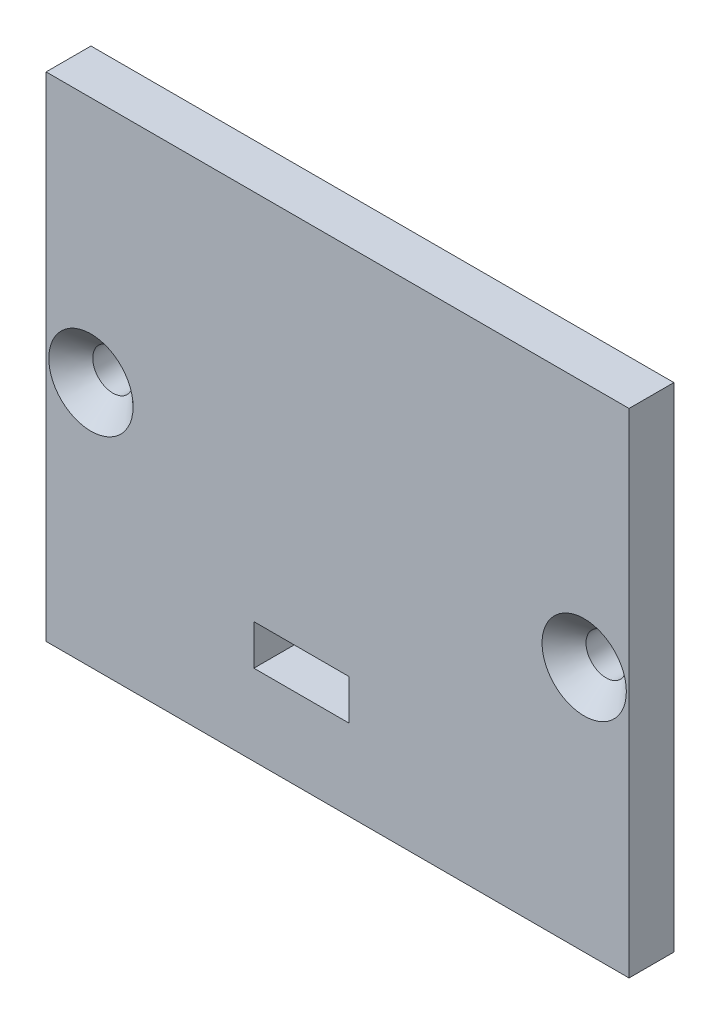
ISO-10303-21;
HEADER;
FILE_DESCRIPTION(('STEP AP214'),'2;1');
FILE_NAME('part.step','',(''),(''),'','','');
FILE_SCHEMA(('AUTOMOTIVE_DESIGN { 1 0 10303 214 1 1 1 1 }'));
ENDSEC;
DATA;
#1=APPLICATION_CONTEXT('core data for automotive mechanical design processes');
#2=APPLICATION_PROTOCOL_DEFINITION('international standard','automotive_design',2000,#1);
#3=PRODUCT_CONTEXT('',#1,'mechanical');
#4=PRODUCT('Part','Part','',(#3));
#5=PRODUCT_RELATED_PRODUCT_CATEGORY('part','',(#4));
#6=PRODUCT_DEFINITION_FORMATION('','',#4);
#7=PRODUCT_DEFINITION_CONTEXT('part definition',#1,'design');
#8=PRODUCT_DEFINITION('design','',#6,#7);
#9=PRODUCT_DEFINITION_SHAPE('','',#8);
#10=(LENGTH_UNIT() NAMED_UNIT(*) SI_UNIT(.MILLI.,.METRE.));
#11=(NAMED_UNIT(*) PLANE_ANGLE_UNIT() SI_UNIT($,.RADIAN.));
#12=(NAMED_UNIT(*) SI_UNIT($,.STERADIAN.) SOLID_ANGLE_UNIT());
#13=UNCERTAINTY_MEASURE_WITH_UNIT(LENGTH_MEASURE(1.E-05),#10,'distance_accuracy_value','');
#14=(GEOMETRIC_REPRESENTATION_CONTEXT(3) GLOBAL_UNCERTAINTY_ASSIGNED_CONTEXT((#13)) GLOBAL_UNIT_ASSIGNED_CONTEXT((#10,
#11,#12)) REPRESENTATION_CONTEXT('',''));
#15=CARTESIAN_POINT('',(0.,0.,0.));
#16=DIRECTION('',(0.,0.,1.));
#17=DIRECTION('',(1.,0.,0.));
#18=AXIS2_PLACEMENT_3D('',#15,#16,#17);
#19=CARTESIAN_POINT('',(0.,0.,5.));
#20=DIRECTION('',(1.,0.,0.));
#21=DIRECTION('',(0.,0.,-1.));
#22=AXIS2_PLACEMENT_3D('',#19,#20,#21);
#23=PLANE('',#22);
#24=DIRECTION('',(0.,-1.,0.));
#25=VECTOR('',#24,1.);
#26=CARTESIAN_POINT('',(0.,0.,0.));
#27=LINE('',#26,#25);
#28=CARTESIAN_POINT('',(0.,55.,0.));
#29=VERTEX_POINT('',#28);
#30=CARTESIAN_POINT('',(0.,0.,0.));
#31=VERTEX_POINT('',#30);
#32=EDGE_CURVE('E150',#29,#31,#27,.T.);
#33=ORIENTED_EDGE('',*,*,#32,.T.);
#34=DIRECTION('',(0.,0.,-1.));
#35=VECTOR('',#34,1.);
#36=CARTESIAN_POINT('',(0.,0.,5.));
#37=LINE('',#36,#35);
#38=CARTESIAN_POINT('',(0.,0.,5.));
#39=VERTEX_POINT('',#38);
#40=EDGE_CURVE('E11',#39,#31,#37,.T.);
#41=ORIENTED_EDGE('',*,*,#40,.F.);
#42=DIRECTION('',(0.,-1.,0.));
#43=VECTOR('',#42,1.);
#44=CARTESIAN_POINT('',(0.,0.,5.));
#45=LINE('',#44,#43);
#46=CARTESIAN_POINT('',(0.,55.,5.));
#47=VERTEX_POINT('',#46);
#48=EDGE_CURVE('E151',#47,#39,#45,.T.);
#49=ORIENTED_EDGE('',*,*,#48,.F.);
#50=DIRECTION('',(0.,0.,-1.));
#51=VECTOR('',#50,1.);
#52=CARTESIAN_POINT('',(0.,55.,5.));
#53=LINE('',#52,#51);
#54=EDGE_CURVE('E161',#47,#29,#53,.T.);
#55=ORIENTED_EDGE('',*,*,#54,.T.);
#56=EDGE_LOOP('',(#33,#41,#49,#55));
#57=FACE_BOUND('',#56,.T.);
#58=ADVANCED_FACE('F32',(#57),#23,.F.);
#59=CARTESIAN_POINT('',(0.,0.,5.));
#60=DIRECTION('',(0.,1.,0.));
#61=DIRECTION('',(0.,0.,1.));
#62=AXIS2_PLACEMENT_3D('',#59,#60,#61);
#63=PLANE('',#62);
#64=DIRECTION('',(1.,0.,0.));
#65=VECTOR('',#64,1.);
#66=CARTESIAN_POINT('',(0.,0.,0.));
#67=LINE('',#66,#65);
#68=CARTESIAN_POINT('',(65.,0.,0.));
#69=VERTEX_POINT('',#68);
#70=EDGE_CURVE('E164',#31,#69,#67,.T.);
#71=ORIENTED_EDGE('',*,*,#70,.T.);
#72=DIRECTION('',(0.,0.,-1.));
#73=VECTOR('',#72,1.);
#74=CARTESIAN_POINT('',(65.,0.,5.));
#75=LINE('',#74,#73);
#76=CARTESIAN_POINT('',(65.,0.,5.));
#77=VERTEX_POINT('',#76);
#78=EDGE_CURVE('E39',#77,#69,#75,.T.);
#79=ORIENTED_EDGE('',*,*,#78,.F.);
#80=DIRECTION('',(1.,0.,0.));
#81=VECTOR('',#80,1.);
#82=CARTESIAN_POINT('',(0.,0.,5.));
#83=LINE('',#82,#81);
#84=EDGE_CURVE('E154',#39,#77,#83,.T.);
#85=ORIENTED_EDGE('',*,*,#84,.F.);
#86=ORIENTED_EDGE('',*,*,#40,.T.);
#87=EDGE_LOOP('',(#71,#79,#85,#86));
#88=FACE_BOUND('',#87,.T.);
#89=ADVANCED_FACE('F193',(#88),#63,.F.);
#90=CARTESIAN_POINT('',(65.,0.,5.));
#91=DIRECTION('',(-1.,0.,0.));
#92=DIRECTION('',(0.,0.,1.));
#93=AXIS2_PLACEMENT_3D('',#90,#91,#92);
#94=PLANE('',#93);
#95=DIRECTION('',(0.,1.,0.));
#96=VECTOR('',#95,1.);
#97=CARTESIAN_POINT('',(65.,0.,0.));
#98=LINE('',#97,#96);
#99=CARTESIAN_POINT('',(65.,55.,0.));
#100=VERTEX_POINT('',#99);
#101=EDGE_CURVE('E166',#69,#100,#98,.T.);
#102=ORIENTED_EDGE('',*,*,#101,.T.);
#103=DIRECTION('',(0.,0.,-1.));
#104=VECTOR('',#103,1.);
#105=CARTESIAN_POINT('',(65.,55.,5.));
#106=LINE('',#105,#104);
#107=CARTESIAN_POINT('',(65.,55.,5.));
#108=VERTEX_POINT('',#107);
#109=EDGE_CURVE('E171',#108,#100,#106,.T.);
#110=ORIENTED_EDGE('',*,*,#109,.F.);
#111=DIRECTION('',(0.,1.,0.));
#112=VECTOR('',#111,1.);
#113=CARTESIAN_POINT('',(65.,0.,5.));
#114=LINE('',#113,#112);
#115=EDGE_CURVE('E157',#77,#108,#114,.T.);
#116=ORIENTED_EDGE('',*,*,#115,.F.);
#117=ORIENTED_EDGE('',*,*,#78,.T.);
#118=EDGE_LOOP('',(#102,#110,#116,#117));
#119=FACE_BOUND('',#118,.T.);
#120=ADVANCED_FACE('F178',(#119),#94,.F.);
#121=CARTESIAN_POINT('',(0.,55.,5.));
#122=DIRECTION('',(0.,-1.,0.));
#123=DIRECTION('',(0.,0.,-1.));
#124=AXIS2_PLACEMENT_3D('',#121,#122,#123);
#125=PLANE('',#124);
#126=DIRECTION('',(-1.,0.,0.));
#127=VECTOR('',#126,1.);
#128=CARTESIAN_POINT('',(0.,55.,0.));
#129=LINE('',#128,#127);
#130=EDGE_CURVE('E155',#100,#29,#129,.T.);
#131=ORIENTED_EDGE('',*,*,#130,.T.);
#132=ORIENTED_EDGE('',*,*,#54,.F.);
#133=DIRECTION('',(-1.,0.,0.));
#134=VECTOR('',#133,1.);
#135=CARTESIAN_POINT('',(0.,55.,5.));
#136=LINE('',#135,#134);
#137=EDGE_CURVE('E159',#108,#47,#136,.T.);
#138=ORIENTED_EDGE('',*,*,#137,.F.);
#139=ORIENTED_EDGE('',*,*,#109,.T.);
#140=EDGE_LOOP('',(#131,#132,#138,#139));
#141=FACE_BOUND('',#140,.T.);
#142=ADVANCED_FACE('F186',(#141),#125,.F.);
#143=CARTESIAN_POINT('',(0.,0.,5.));
#144=DIRECTION('',(0.,0.,-1.));
#145=DIRECTION('',(-1.,0.,0.));
#146=AXIS2_PLACEMENT_3D('',#143,#144,#145);
#147=PLANE('',#146);
#148=DIRECTION('',(0.,-1.,0.));
#149=VECTOR('',#148,1.);
#150=CARTESIAN_POINT('',(23.1683541513135,9.,5.));
#151=LINE('',#150,#149);
#152=CARTESIAN_POINT('',(23.1683541513135,13.5,5.));
#153=VERTEX_POINT('',#152);
#154=CARTESIAN_POINT('',(23.1683541513135,9.,5.));
#155=VERTEX_POINT('',#154);
#156=EDGE_CURVE('E123',#153,#155,#151,.T.);
#157=ORIENTED_EDGE('',*,*,#156,.F.);
#158=DIRECTION('',(-1.,0.,0.));
#159=VECTOR('',#158,1.);
#160=CARTESIAN_POINT('',(23.1683541513135,13.5,5.));
#161=LINE('',#160,#159);
#162=CARTESIAN_POINT('',(33.7684187196315,13.5,5.));
#163=VERTEX_POINT('',#162);
#164=EDGE_CURVE('E46',#163,#153,#161,.T.);
#165=ORIENTED_EDGE('',*,*,#164,.F.);
#166=DIRECTION('',(0.,1.,0.));
#167=VECTOR('',#166,1.);
#168=CARTESIAN_POINT('',(33.7684187196315,13.5,5.));
#169=LINE('',#168,#167);
#170=CARTESIAN_POINT('',(33.7684187196315,9.,5.));
#171=VERTEX_POINT('',#170);
#172=EDGE_CURVE('E114',#171,#163,#169,.T.);
#173=ORIENTED_EDGE('',*,*,#172,.F.);
#174=DIRECTION('',(1.,0.,0.));
#175=VECTOR('',#174,1.);
#176=CARTESIAN_POINT('',(33.7684187196315,9.,5.));
#177=LINE('',#176,#175);
#178=EDGE_CURVE('E117',#155,#171,#177,.T.);
#179=ORIENTED_EDGE('',*,*,#178,.F.);
#180=EDGE_LOOP('',(#157,#165,#173,#179));
#181=FACE_BOUND('',#180,.T.);
#182=CARTESIAN_POINT('',(5.,27.5,5.));
#183=DIRECTION('',(0.,0.,1.));
#184=DIRECTION('',(1.,0.,0.));
#185=AXIS2_PLACEMENT_3D('',#182,#183,#184);
#186=CIRCLE('',#185,4.7);
#187=CARTESIAN_POINT('',(9.7,27.5,5.));
#188=VERTEX_POINT('',#187);
#189=EDGE_CURVE('E129',#188,#188,#186,.T.);
#190=ORIENTED_EDGE('',*,*,#189,.F.);
#191=EDGE_LOOP('',(#190));
#192=FACE_BOUND('',#191,.T.);
#193=CARTESIAN_POINT('',(60.,27.5,5.));
#194=DIRECTION('',(0.,0.,1.));
#195=DIRECTION('',(1.,0.,0.));
#196=AXIS2_PLACEMENT_3D('',#193,#194,#195);
#197=CIRCLE('',#196,4.7);
#198=CARTESIAN_POINT('',(64.7,27.5,5.));
#199=VERTEX_POINT('',#198);
#200=EDGE_CURVE('E141',#199,#199,#197,.T.);
#201=ORIENTED_EDGE('',*,*,#200,.F.);
#202=EDGE_LOOP('',(#201));
#203=FACE_BOUND('',#202,.T.);
#204=ORIENTED_EDGE('',*,*,#48,.T.);
#205=ORIENTED_EDGE('',*,*,#84,.T.);
#206=ORIENTED_EDGE('',*,*,#115,.T.);
#207=ORIENTED_EDGE('',*,*,#137,.T.);
#208=EDGE_LOOP('',(#204,#205,#206,#207));
#209=FACE_BOUND('',#208,.T.);
#210=ADVANCED_FACE('F192',(#181,#192,#203,#209),#147,.F.);
#211=CARTESIAN_POINT('',(0.,0.,0.));
#212=DIRECTION('',(0.,0.,-1.));
#213=DIRECTION('',(-1.,0.,0.));
#214=AXIS2_PLACEMENT_3D('',#211,#212,#213);
#215=PLANE('',#214);
#216=DIRECTION('',(-1.,0.,0.));
#217=VECTOR('',#216,1.);
#218=CARTESIAN_POINT('',(23.1683541513135,13.5,0.));
#219=LINE('',#218,#217);
#220=CARTESIAN_POINT('',(33.7684187196315,13.5,0.));
#221=VERTEX_POINT('',#220);
#222=CARTESIAN_POINT('',(23.1683541513135,13.5,0.));
#223=VERTEX_POINT('',#222);
#224=EDGE_CURVE('E98',#221,#223,#219,.T.);
#225=ORIENTED_EDGE('',*,*,#224,.T.);
#226=DIRECTION('',(0.,-1.,0.));
#227=VECTOR('',#226,1.);
#228=CARTESIAN_POINT('',(23.1683541513135,9.,0.));
#229=LINE('',#228,#227);
#230=CARTESIAN_POINT('',(23.1683541513135,9.,0.));
#231=VERTEX_POINT('',#230);
#232=EDGE_CURVE('E107',#223,#231,#229,.T.);
#233=ORIENTED_EDGE('',*,*,#232,.T.);
#234=DIRECTION('',(1.,0.,0.));
#235=VECTOR('',#234,1.);
#236=CARTESIAN_POINT('',(33.7684187196315,9.,0.));
#237=LINE('',#236,#235);
#238=CARTESIAN_POINT('',(33.7684187196315,9.,0.));
#239=VERTEX_POINT('',#238);
#240=EDGE_CURVE('E54',#231,#239,#237,.T.);
#241=ORIENTED_EDGE('',*,*,#240,.T.);
#242=DIRECTION('',(0.,1.,0.));
#243=VECTOR('',#242,1.);
#244=CARTESIAN_POINT('',(33.7684187196315,13.5,0.));
#245=LINE('',#244,#243);
#246=EDGE_CURVE('E104',#239,#221,#245,.T.);
#247=ORIENTED_EDGE('',*,*,#246,.T.);
#248=EDGE_LOOP('',(#225,#233,#241,#247));
#249=FACE_BOUND('',#248,.T.);
#250=CARTESIAN_POINT('',(5.,27.5,0.));
#251=DIRECTION('',(0.,0.,1.));
#252=DIRECTION('',(1.,0.,0.));
#253=AXIS2_PLACEMENT_3D('',#250,#251,#252);
#254=CIRCLE('',#253,2.25);
#255=CARTESIAN_POINT('',(7.25,27.5,0.));
#256=VERTEX_POINT('',#255);
#257=EDGE_CURVE('E138',#256,#256,#254,.T.);
#258=ORIENTED_EDGE('',*,*,#257,.T.);
#259=EDGE_LOOP('',(#258));
#260=FACE_BOUND('',#259,.T.);
#261=CARTESIAN_POINT('',(60.,27.5,0.));
#262=DIRECTION('',(0.,0.,1.));
#263=DIRECTION('',(1.,0.,0.));
#264=AXIS2_PLACEMENT_3D('',#261,#262,#263);
#265=CIRCLE('',#264,2.25);
#266=CARTESIAN_POINT('',(62.25,27.5,0.));
#267=VERTEX_POINT('',#266);
#268=EDGE_CURVE('E147',#267,#267,#265,.T.);
#269=ORIENTED_EDGE('',*,*,#268,.T.);
#270=EDGE_LOOP('',(#269));
#271=FACE_BOUND('',#270,.T.);
#272=ORIENTED_EDGE('',*,*,#32,.F.);
#273=ORIENTED_EDGE('',*,*,#130,.F.);
#274=ORIENTED_EDGE('',*,*,#101,.F.);
#275=ORIENTED_EDGE('',*,*,#70,.F.);
#276=EDGE_LOOP('',(#272,#273,#274,#275));
#277=FACE_BOUND('',#276,.T.);
#278=ADVANCED_FACE('F111',(#249,#260,#271,#277),#215,.T.);
#279=CARTESIAN_POINT('',(60.,27.5,5.));
#280=DIRECTION('',(0.,0.,1.));
#281=DIRECTION('',(1.,0.,0.));
#282=AXIS2_PLACEMENT_3D('',#279,#280,#281);
#283=CYLINDRICAL_SURFACE('',#282,2.25);
#284=ORIENTED_EDGE('',*,*,#268,.F.);
#285=EDGE_LOOP('',(#284));
#286=FACE_BOUND('',#285,.T.);
#287=CARTESIAN_POINT('',(60.,27.5,2.55));
#288=DIRECTION('',(0.,0.,1.));
#289=DIRECTION('',(1.,0.,0.));
#290=AXIS2_PLACEMENT_3D('',#287,#288,#289);
#291=CIRCLE('',#290,2.25);
#292=CARTESIAN_POINT('',(62.25,27.5,2.55));
#293=VERTEX_POINT('',#292);
#294=EDGE_CURVE('E144',#293,#293,#291,.T.);
#295=ORIENTED_EDGE('',*,*,#294,.T.);
#296=EDGE_LOOP('',(#295));
#297=FACE_BOUND('',#296,.T.);
#298=ADVANCED_FACE('F205',(#286,#297),#283,.F.);
#299=CARTESIAN_POINT('',(60.,27.5,5.));
#300=DIRECTION('',(0.,0.,1.));
#301=DIRECTION('',(1.,0.,0.));
#302=AXIS2_PLACEMENT_3D('',#299,#300,#301);
#303=CONICAL_SURFACE('',#302,4.7,0.785398163397449);
#304=ORIENTED_EDGE('',*,*,#294,.F.);
#305=EDGE_LOOP('',(#304));
#306=FACE_BOUND('',#305,.T.);
#307=ORIENTED_EDGE('',*,*,#200,.T.);
#308=EDGE_LOOP('',(#307));
#309=FACE_BOUND('',#308,.T.);
#310=ADVANCED_FACE('F211',(#306,#309),#303,.F.);
#311=CARTESIAN_POINT('',(5.,27.5,5.));
#312=DIRECTION('',(0.,0.,1.));
#313=DIRECTION('',(1.,0.,0.));
#314=AXIS2_PLACEMENT_3D('',#311,#312,#313);
#315=CYLINDRICAL_SURFACE('',#314,2.25);
#316=ORIENTED_EDGE('',*,*,#257,.F.);
#317=EDGE_LOOP('',(#316));
#318=FACE_BOUND('',#317,.T.);
#319=CARTESIAN_POINT('',(5.,27.5,2.55));
#320=DIRECTION('',(0.,0.,1.));
#321=DIRECTION('',(1.,0.,0.));
#322=AXIS2_PLACEMENT_3D('',#319,#320,#321);
#323=CIRCLE('',#322,2.25);
#324=CARTESIAN_POINT('',(7.25,27.5,2.55));
#325=VERTEX_POINT('',#324);
#326=EDGE_CURVE('E135',#325,#325,#323,.T.);
#327=ORIENTED_EDGE('',*,*,#326,.T.);
#328=EDGE_LOOP('',(#327));
#329=FACE_BOUND('',#328,.T.);
#330=ADVANCED_FACE('F215',(#318,#329),#315,.F.);
#331=CARTESIAN_POINT('',(5.,27.5,5.));
#332=DIRECTION('',(0.,0.,1.));
#333=DIRECTION('',(1.,0.,0.));
#334=AXIS2_PLACEMENT_3D('',#331,#332,#333);
#335=CONICAL_SURFACE('',#334,4.7,0.785398163397448);
#336=ORIENTED_EDGE('',*,*,#326,.F.);
#337=EDGE_LOOP('',(#336));
#338=FACE_BOUND('',#337,.T.);
#339=ORIENTED_EDGE('',*,*,#189,.T.);
#340=EDGE_LOOP('',(#339));
#341=FACE_BOUND('',#340,.T.);
#342=ADVANCED_FACE('F219',(#338,#341),#335,.F.);
#343=CARTESIAN_POINT('',(23.1683541513135,13.5,0.));
#344=DIRECTION('',(0.,1.,0.));
#345=DIRECTION('',(0.,0.,1.));
#346=AXIS2_PLACEMENT_3D('',#343,#344,#345);
#347=PLANE('',#346);
#348=ORIENTED_EDGE('',*,*,#164,.T.);
#349=DIRECTION('',(0.,0.,1.));
#350=VECTOR('',#349,1.);
#351=CARTESIAN_POINT('',(23.1683541513135,13.5,0.));
#352=LINE('',#351,#350);
#353=EDGE_CURVE('E94',#223,#153,#352,.T.);
#354=ORIENTED_EDGE('',*,*,#353,.F.);
#355=ORIENTED_EDGE('',*,*,#224,.F.);
#356=DIRECTION('',(0.,0.,1.));
#357=VECTOR('',#356,1.);
#358=CARTESIAN_POINT('',(33.7684187196315,13.5,0.));
#359=LINE('',#358,#357);
#360=EDGE_CURVE('E127',#221,#163,#359,.T.);
#361=ORIENTED_EDGE('',*,*,#360,.T.);
#362=EDGE_LOOP('',(#348,#354,#355,#361));
#363=FACE_BOUND('',#362,.T.);
#364=ADVANCED_FACE('F96',(#363),#347,.F.);
#365=CARTESIAN_POINT('',(33.7684187196315,13.5,0.));
#366=DIRECTION('',(1.,0.,0.));
#367=DIRECTION('',(0.,0.,-1.));
#368=AXIS2_PLACEMENT_3D('',#365,#366,#367);
#369=PLANE('',#368);
#370=ORIENTED_EDGE('',*,*,#172,.T.);
#371=ORIENTED_EDGE('',*,*,#360,.F.);
#372=ORIENTED_EDGE('',*,*,#246,.F.);
#373=DIRECTION('',(0.,0.,1.));
#374=VECTOR('',#373,1.);
#375=CARTESIAN_POINT('',(33.7684187196315,9.,0.));
#376=LINE('',#375,#374);
#377=EDGE_CURVE('E130',#239,#171,#376,.T.);
#378=ORIENTED_EDGE('',*,*,#377,.T.);
#379=EDGE_LOOP('',(#370,#371,#372,#378));
#380=FACE_BOUND('',#379,.T.);
#381=ADVANCED_FACE('F226',(#380),#369,.F.);
#382=CARTESIAN_POINT('',(33.7684187196315,9.,0.));
#383=DIRECTION('',(0.,-1.,0.));
#384=DIRECTION('',(0.,0.,-1.));
#385=AXIS2_PLACEMENT_3D('',#382,#383,#384);
#386=PLANE('',#385);
#387=ORIENTED_EDGE('',*,*,#178,.T.);
#388=ORIENTED_EDGE('',*,*,#377,.F.);
#389=ORIENTED_EDGE('',*,*,#240,.F.);
#390=DIRECTION('',(0.,0.,1.));
#391=VECTOR('',#390,1.);
#392=CARTESIAN_POINT('',(23.1683541513135,9.,0.));
#393=LINE('',#392,#391);
#394=EDGE_CURVE('E103',#231,#155,#393,.T.);
#395=ORIENTED_EDGE('',*,*,#394,.T.);
#396=EDGE_LOOP('',(#387,#388,#389,#395));
#397=FACE_BOUND('',#396,.T.);
#398=ADVANCED_FACE('F229',(#397),#386,.F.);
#399=CARTESIAN_POINT('',(23.1683541513135,9.,0.));
#400=DIRECTION('',(-1.,0.,0.));
#401=DIRECTION('',(0.,-1.,0.));
#402=AXIS2_PLACEMENT_3D('',#399,#400,#401);
#403=PLANE('',#402);
#404=ORIENTED_EDGE('',*,*,#156,.T.);
#405=ORIENTED_EDGE('',*,*,#394,.F.);
#406=ORIENTED_EDGE('',*,*,#232,.F.);
#407=ORIENTED_EDGE('',*,*,#353,.T.);
#408=EDGE_LOOP('',(#404,#405,#406,#407));
#409=FACE_BOUND('',#408,.T.);
#410=ADVANCED_FACE('F108',(#409),#403,.F.);
#411=CLOSED_SHELL('',(#58,#89,#120,#142,#210,#278,#298,#310,#330,#342,#364,#381,#398,#410));
#412=MANIFOLD_SOLID_BREP('B2',#411);
#413=ADVANCED_BREP_SHAPE_REPRESENTATION('',(#18,#412),#14);
#414=SHAPE_DEFINITION_REPRESENTATION(#9,#413);
ENDSEC;
END-ISO-10303-21;
